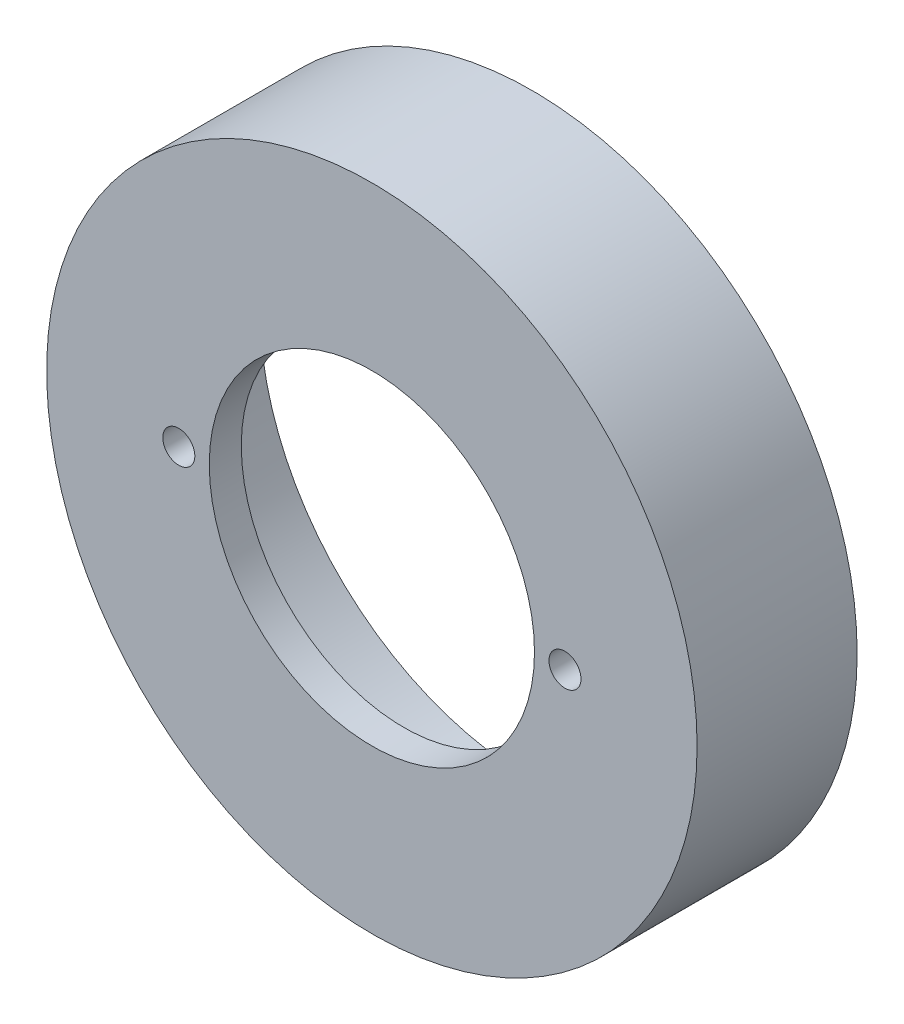
ISO-10303-21;
HEADER;
FILE_DESCRIPTION(('STEP AP214'),'2;1');
FILE_NAME('part.step','',(''),(''),'','','');
FILE_SCHEMA(('AUTOMOTIVE_DESIGN { 1 0 10303 214 1 1 1 1 }'));
ENDSEC;
DATA;
#1=APPLICATION_CONTEXT('core data for automotive mechanical design processes');
#2=APPLICATION_PROTOCOL_DEFINITION('international standard','automotive_design',2000,#1);
#3=PRODUCT_CONTEXT('',#1,'mechanical');
#4=PRODUCT('Part','Part','',(#3));
#5=PRODUCT_RELATED_PRODUCT_CATEGORY('part','',(#4));
#6=PRODUCT_DEFINITION_FORMATION('','',#4);
#7=PRODUCT_DEFINITION_CONTEXT('part definition',#1,'design');
#8=PRODUCT_DEFINITION('design','',#6,#7);
#9=PRODUCT_DEFINITION_SHAPE('','',#8);
#10=(LENGTH_UNIT() NAMED_UNIT(*) SI_UNIT(.MILLI.,.METRE.));
#11=(NAMED_UNIT(*) PLANE_ANGLE_UNIT() SI_UNIT($,.RADIAN.));
#12=(NAMED_UNIT(*) SI_UNIT($,.STERADIAN.) SOLID_ANGLE_UNIT());
#13=UNCERTAINTY_MEASURE_WITH_UNIT(LENGTH_MEASURE(1.E-05),#10,'distance_accuracy_value','');
#14=(GEOMETRIC_REPRESENTATION_CONTEXT(3) GLOBAL_UNCERTAINTY_ASSIGNED_CONTEXT((#13)) GLOBAL_UNIT_ASSIGNED_CONTEXT((#10,
#11,#12)) REPRESENTATION_CONTEXT('',''));
#15=CARTESIAN_POINT('',(0.,0.,0.));
#16=DIRECTION('',(0.,0.,1.));
#17=DIRECTION('',(1.,0.,0.));
#18=AXIS2_PLACEMENT_3D('',#15,#16,#17);
#19=CARTESIAN_POINT('',(0.,0.,25.));
#20=DIRECTION('',(0.,0.,-1.));
#21=DIRECTION('',(-1.,0.,0.));
#22=AXIS2_PLACEMENT_3D('',#19,#20,#21);
#23=CYLINDRICAL_SURFACE('',#22,50.8);
#24=CARTESIAN_POINT('',(0.,0.,25.));
#25=DIRECTION('',(0.,0.,1.));
#26=DIRECTION('',(1.,0.,0.));
#27=AXIS2_PLACEMENT_3D('',#24,#25,#26);
#28=CIRCLE('',#27,50.8);
#29=CARTESIAN_POINT('',(50.8,0.,25.));
#30=VERTEX_POINT('',#29);
#31=EDGE_CURVE('E11',#30,#30,#28,.T.);
#32=ORIENTED_EDGE('',*,*,#31,.F.);
#33=EDGE_LOOP('',(#32));
#34=FACE_BOUND('',#33,.T.);
#35=CARTESIAN_POINT('',(0.,0.,0.));
#36=DIRECTION('',(0.,0.,1.));
#37=DIRECTION('',(1.,0.,0.));
#38=AXIS2_PLACEMENT_3D('',#35,#36,#37);
#39=CIRCLE('',#38,50.8);
#40=CARTESIAN_POINT('',(50.8,0.,0.));
#41=VERTEX_POINT('',#40);
#42=EDGE_CURVE('E49',#41,#41,#39,.T.);
#43=ORIENTED_EDGE('',*,*,#42,.T.);
#44=EDGE_LOOP('',(#43));
#45=FACE_BOUND('',#44,.T.);
#46=ADVANCED_FACE('F41',(#34,#45),#23,.T.);
#47=CARTESIAN_POINT('',(0.,0.,25.));
#48=DIRECTION('',(0.,0.,1.));
#49=DIRECTION('',(1.,0.,0.));
#50=AXIS2_PLACEMENT_3D('',#47,#48,#49);
#51=PLANE('',#50);
#52=CARTESIAN_POINT('',(30.16,0.,25.));
#53=DIRECTION('',(0.,0.,-1.));
#54=DIRECTION('',(-1.,0.,0.));
#55=AXIS2_PLACEMENT_3D('',#52,#53,#54);
#56=CIRCLE('',#55,2.5);
#57=CARTESIAN_POINT('',(27.66,0.,25.));
#58=VERTEX_POINT('',#57);
#59=EDGE_CURVE('E68',#58,#58,#56,.T.);
#60=ORIENTED_EDGE('',*,*,#59,.T.);
#61=EDGE_LOOP('',(#60));
#62=FACE_BOUND('',#61,.T.);
#63=CARTESIAN_POINT('',(-30.16,-2.10606154359018E-13,25.));
#64=DIRECTION('',(0.,0.,-1.));
#65=DIRECTION('',(-1.,0.,0.));
#66=AXIS2_PLACEMENT_3D('',#63,#64,#65);
#67=CIRCLE('',#66,2.5);
#68=CARTESIAN_POINT('',(-32.66,-2.10606154359018E-13,25.));
#69=VERTEX_POINT('',#68);
#70=EDGE_CURVE('E73',#69,#69,#67,.T.);
#71=ORIENTED_EDGE('',*,*,#70,.T.);
#72=EDGE_LOOP('',(#71));
#73=FACE_BOUND('',#72,.T.);
#74=CARTESIAN_POINT('',(0.,0.,25.));
#75=DIRECTION('',(0.,0.,1.));
#76=DIRECTION('',(1.,0.,0.));
#77=AXIS2_PLACEMENT_3D('',#74,#75,#76);
#78=CIRCLE('',#77,25.4);
#79=CARTESIAN_POINT('',(25.4,0.,25.));
#80=VERTEX_POINT('',#79);
#81=EDGE_CURVE('E55',#80,#80,#78,.T.);
#82=ORIENTED_EDGE('',*,*,#81,.F.);
#83=EDGE_LOOP('',(#82));
#84=FACE_BOUND('',#83,.T.);
#85=ORIENTED_EDGE('',*,*,#31,.T.);
#86=EDGE_LOOP('',(#85));
#87=FACE_BOUND('',#86,.T.);
#88=ADVANCED_FACE('F114',(#62,#73,#84,#87),#51,.T.);
#89=CARTESIAN_POINT('',(0.,0.,0.));
#90=DIRECTION('',(0.,0.,1.));
#91=DIRECTION('',(1.,0.,0.));
#92=AXIS2_PLACEMENT_3D('',#89,#90,#91);
#93=PLANE('',#92);
#94=CARTESIAN_POINT('',(0.,46.647557518989,0.));
#95=DIRECTION('',(0.,0.,-1.));
#96=DIRECTION('',(-1.,0.,0.));
#97=AXIS2_PLACEMENT_3D('',#94,#95,#96);
#98=CIRCLE('',#97,2.);
#99=CARTESIAN_POINT('',(-2.,46.647557518989,0.));
#100=VERTEX_POINT('',#99);
#101=EDGE_CURVE('E93',#100,#100,#98,.T.);
#102=ORIENTED_EDGE('',*,*,#101,.F.);
#103=EDGE_LOOP('',(#102));
#104=FACE_BOUND('',#103,.T.);
#105=CARTESIAN_POINT('',(3.6273428558721E-13,-47.352442481011,0.));
#106=DIRECTION('',(0.,0.,-1.));
#107=DIRECTION('',(-1.,0.,0.));
#108=AXIS2_PLACEMENT_3D('',#105,#106,#107);
#109=CIRCLE('',#108,2.);
#110=CARTESIAN_POINT('',(-1.99999999999964,-47.352442481011,0.));
#111=VERTEX_POINT('',#110);
#112=EDGE_CURVE('E85',#111,#111,#109,.T.);
#113=ORIENTED_EDGE('',*,*,#112,.F.);
#114=EDGE_LOOP('',(#113));
#115=FACE_BOUND('',#114,.T.);
#116=CARTESIAN_POINT('',(0.,0.,0.));
#117=DIRECTION('',(0.,0.,-1.));
#118=DIRECTION('',(-1.,0.,0.));
#119=AXIS2_PLACEMENT_3D('',#116,#117,#118);
#120=CIRCLE('',#119,42.5);
#121=CARTESIAN_POINT('',(-42.5,0.,0.));
#122=VERTEX_POINT('',#121);
#123=EDGE_CURVE('E64',#122,#122,#120,.T.);
#124=ORIENTED_EDGE('',*,*,#123,.F.);
#125=EDGE_LOOP('',(#124));
#126=FACE_BOUND('',#125,.T.);
#127=ORIENTED_EDGE('',*,*,#42,.F.);
#128=EDGE_LOOP('',(#127));
#129=FACE_BOUND('',#128,.T.);
#130=ADVANCED_FACE('F110',(#104,#115,#126,#129),#93,.F.);
#131=CARTESIAN_POINT('',(0.,0.,0.));
#132=DIRECTION('',(0.,0.,1.));
#133=DIRECTION('',(1.,0.,0.));
#134=AXIS2_PLACEMENT_3D('',#131,#132,#133);
#135=CYLINDRICAL_SURFACE('',#134,25.4);
#136=CARTESIAN_POINT('',(0.,0.,20.));
#137=DIRECTION('',(0.,0.,1.));
#138=DIRECTION('',(1.,0.,0.));
#139=AXIS2_PLACEMENT_3D('',#136,#137,#138);
#140=CIRCLE('',#139,25.4);
#141=CARTESIAN_POINT('',(25.4,0.,20.));
#142=VERTEX_POINT('',#141);
#143=EDGE_CURVE('E44',#142,#142,#140,.F.);
#144=ORIENTED_EDGE('',*,*,#143,.T.);
#145=EDGE_LOOP('',(#144));
#146=FACE_BOUND('',#145,.T.);
#147=ORIENTED_EDGE('',*,*,#81,.T.);
#148=EDGE_LOOP('',(#147));
#149=FACE_BOUND('',#148,.T.);
#150=ADVANCED_FACE('F113',(#146,#149),#135,.F.);
#151=CARTESIAN_POINT('',(0.,0.,20.));
#152=DIRECTION('',(0.,0.,1.));
#153=DIRECTION('',(1.,0.,0.));
#154=AXIS2_PLACEMENT_3D('',#151,#152,#153);
#155=PLANE('',#154);
#156=CARTESIAN_POINT('',(30.16,0.,20.));
#157=DIRECTION('',(0.,0.,-1.));
#158=DIRECTION('',(-1.,0.,0.));
#159=AXIS2_PLACEMENT_3D('',#156,#157,#158);
#160=CIRCLE('',#159,2.5);
#161=CARTESIAN_POINT('',(27.66,0.,20.));
#162=VERTEX_POINT('',#161);
#163=EDGE_CURVE('E78',#162,#162,#160,.T.);
#164=ORIENTED_EDGE('',*,*,#163,.F.);
#165=EDGE_LOOP('',(#164));
#166=FACE_BOUND('',#165,.T.);
#167=CARTESIAN_POINT('',(-30.16,-2.10606154359018E-13,20.));
#168=DIRECTION('',(0.,0.,-1.));
#169=DIRECTION('',(-1.,0.,0.));
#170=AXIS2_PLACEMENT_3D('',#167,#168,#169);
#171=CIRCLE('',#170,2.5);
#172=CARTESIAN_POINT('',(-32.66,-2.10606154359018E-13,20.));
#173=VERTEX_POINT('',#172);
#174=EDGE_CURVE('E69',#173,#173,#171,.T.);
#175=ORIENTED_EDGE('',*,*,#174,.F.);
#176=EDGE_LOOP('',(#175));
#177=FACE_BOUND('',#176,.T.);
#178=CARTESIAN_POINT('',(0.,0.,20.));
#179=DIRECTION('',(0.,0.,1.));
#180=DIRECTION('',(1.,0.,0.));
#181=AXIS2_PLACEMENT_3D('',#178,#179,#180);
#182=CIRCLE('',#181,42.5);
#183=CARTESIAN_POINT('',(42.5,0.,20.));
#184=VERTEX_POINT('',#183);
#185=EDGE_CURVE('E60',#184,#184,#182,.F.);
#186=ORIENTED_EDGE('',*,*,#185,.T.);
#187=EDGE_LOOP('',(#186));
#188=FACE_BOUND('',#187,.T.);
#189=ORIENTED_EDGE('',*,*,#143,.F.);
#190=EDGE_LOOP('',(#189));
#191=FACE_BOUND('',#190,.T.);
#192=ADVANCED_FACE('F134',(#166,#177,#188,#191),#155,.F.);
#193=CARTESIAN_POINT('',(0.,0.,145.208152801713));
#194=DIRECTION('',(0.,0.,-1.));
#195=DIRECTION('',(-1.,0.,0.));
#196=AXIS2_PLACEMENT_3D('',#193,#194,#195);
#197=CYLINDRICAL_SURFACE('',#196,42.5);
#198=ORIENTED_EDGE('',*,*,#123,.T.);
#199=EDGE_LOOP('',(#198));
#200=FACE_BOUND('',#199,.T.);
#201=ORIENTED_EDGE('',*,*,#185,.F.);
#202=EDGE_LOOP('',(#201));
#203=FACE_BOUND('',#202,.T.);
#204=ADVANCED_FACE('F138',(#200,#203),#197,.F.);
#205=CARTESIAN_POINT('',(-30.16,-2.10606154359018E-13,25.));
#206=DIRECTION('',(0.,0.,-1.));
#207=DIRECTION('',(-1.,0.,0.));
#208=AXIS2_PLACEMENT_3D('',#205,#206,#207);
#209=CYLINDRICAL_SURFACE('',#208,2.5);
#210=ORIENTED_EDGE('',*,*,#70,.F.);
#211=EDGE_LOOP('',(#210));
#212=FACE_BOUND('',#211,.T.);
#213=ORIENTED_EDGE('',*,*,#174,.T.);
#214=EDGE_LOOP('',(#213));
#215=FACE_BOUND('',#214,.T.);
#216=ADVANCED_FACE('F142',(#212,#215),#209,.F.);
#217=CARTESIAN_POINT('',(30.16,0.,25.));
#218=DIRECTION('',(0.,0.,-1.));
#219=DIRECTION('',(-1.,0.,0.));
#220=AXIS2_PLACEMENT_3D('',#217,#218,#219);
#221=CYLINDRICAL_SURFACE('',#220,2.5);
#222=ORIENTED_EDGE('',*,*,#59,.F.);
#223=EDGE_LOOP('',(#222));
#224=FACE_BOUND('',#223,.T.);
#225=ORIENTED_EDGE('',*,*,#163,.T.);
#226=EDGE_LOOP('',(#225));
#227=FACE_BOUND('',#226,.T.);
#228=ADVANCED_FACE('F146',(#224,#227),#221,.F.);
#229=CARTESIAN_POINT('',(3.6273428558721E-13,-47.352442481011,7.5));
#230=DIRECTION('',(0.,0.,-1.));
#231=DIRECTION('',(-1.,0.,0.));
#232=AXIS2_PLACEMENT_3D('',#229,#230,#231);
#233=CYLINDRICAL_SURFACE('',#232,2.);
#234=CARTESIAN_POINT('',(3.6273428558721E-13,-47.352442481011,7.5));
#235=DIRECTION('',(0.,0.,-1.));
#236=DIRECTION('',(-1.,0.,0.));
#237=AXIS2_PLACEMENT_3D('',#234,#235,#236);
#238=CIRCLE('',#237,2.);
#239=CARTESIAN_POINT('',(-1.99999999999964,-47.352442481011,7.5));
#240=VERTEX_POINT('',#239);
#241=EDGE_CURVE('E89',#240,#240,#238,.T.);
#242=ORIENTED_EDGE('',*,*,#241,.F.);
#243=EDGE_LOOP('',(#242));
#244=FACE_BOUND('',#243,.T.);
#245=ORIENTED_EDGE('',*,*,#112,.T.);
#246=EDGE_LOOP('',(#245));
#247=FACE_BOUND('',#246,.T.);
#248=ADVANCED_FACE('F150',(#244,#247),#233,.F.);
#249=CARTESIAN_POINT('',(3.6273428558721E-13,-47.352442481011,7.5));
#250=DIRECTION('',(0.,0.,-1.));
#251=DIRECTION('',(-1.,0.,0.));
#252=AXIS2_PLACEMENT_3D('',#249,#250,#251);
#253=PLANE('',#252);
#254=ORIENTED_EDGE('',*,*,#241,.T.);
#255=EDGE_LOOP('',(#254));
#256=FACE_BOUND('',#255,.T.);
#257=ADVANCED_FACE('F106',(#256),#253,.T.);
#258=CARTESIAN_POINT('',(0.,46.647557518989,7.5));
#259=DIRECTION('',(0.,0.,-1.));
#260=DIRECTION('',(-1.,0.,0.));
#261=AXIS2_PLACEMENT_3D('',#258,#259,#260);
#262=CYLINDRICAL_SURFACE('',#261,2.);
#263=CARTESIAN_POINT('',(0.,46.647557518989,7.5));
#264=DIRECTION('',(0.,0.,-1.));
#265=DIRECTION('',(-1.,0.,0.));
#266=AXIS2_PLACEMENT_3D('',#263,#264,#265);
#267=CIRCLE('',#266,2.);
#268=CARTESIAN_POINT('',(-2.,46.647557518989,7.5));
#269=VERTEX_POINT('',#268);
#270=EDGE_CURVE('E74',#269,#269,#267,.T.);
#271=ORIENTED_EDGE('',*,*,#270,.F.);
#272=EDGE_LOOP('',(#271));
#273=FACE_BOUND('',#272,.T.);
#274=ORIENTED_EDGE('',*,*,#101,.T.);
#275=EDGE_LOOP('',(#274));
#276=FACE_BOUND('',#275,.T.);
#277=ADVANCED_FACE('F103',(#273,#276),#262,.F.);
#278=CARTESIAN_POINT('',(0.,46.647557518989,7.5));
#279=DIRECTION('',(0.,0.,-1.));
#280=DIRECTION('',(-1.,0.,0.));
#281=AXIS2_PLACEMENT_3D('',#278,#279,#280);
#282=PLANE('',#281);
#283=ORIENTED_EDGE('',*,*,#270,.T.);
#284=EDGE_LOOP('',(#283));
#285=FACE_BOUND('',#284,.T.);
#286=ADVANCED_FACE('F101',(#285),#282,.T.);
#287=CLOSED_SHELL('',(#46,#88,#130,#150,#192,#204,#216,#228,#248,#257,#277,#286));
#288=MANIFOLD_SOLID_BREP('B2',#287);
#289=ADVANCED_BREP_SHAPE_REPRESENTATION('',(#18,#288),#14);
#290=SHAPE_DEFINITION_REPRESENTATION(#9,#289);
ENDSEC;
END-ISO-10303-21;
